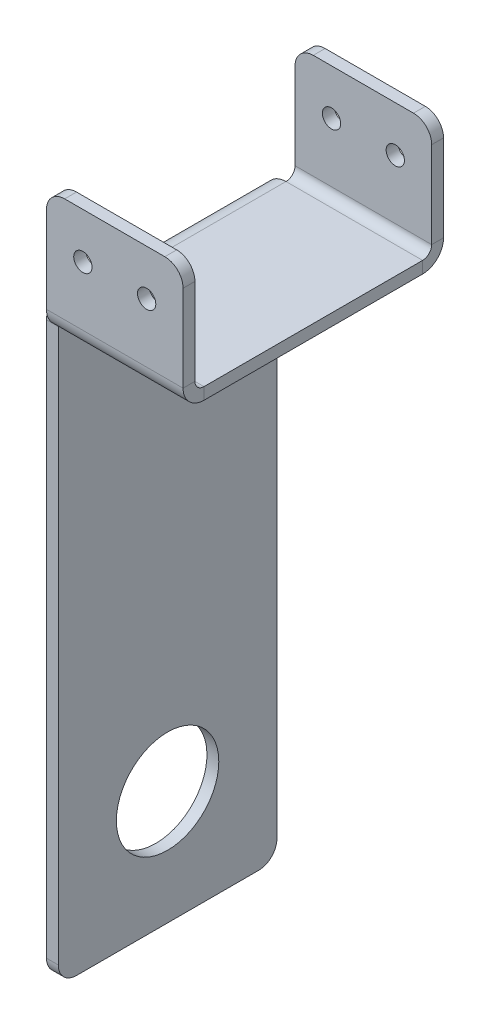
ISO-10303-21;
HEADER;
FILE_DESCRIPTION(('STEP AP214'),'2;1');
FILE_NAME('part.step','',(''),(''),'','','');
FILE_SCHEMA(('AUTOMOTIVE_DESIGN { 1 0 10303 214 1 1 1 1 }'));
ENDSEC;
DATA;
#1=APPLICATION_CONTEXT('core data for automotive mechanical design processes');
#2=APPLICATION_PROTOCOL_DEFINITION('international standard','automotive_design',2000,#1);
#3=PRODUCT_CONTEXT('',#1,'mechanical');
#4=PRODUCT('Part','Part','',(#3));
#5=PRODUCT_RELATED_PRODUCT_CATEGORY('part','',(#4));
#6=PRODUCT_DEFINITION_FORMATION('','',#4);
#7=PRODUCT_DEFINITION_CONTEXT('part definition',#1,'design');
#8=PRODUCT_DEFINITION('design','',#6,#7);
#9=PRODUCT_DEFINITION_SHAPE('','',#8);
#10=(LENGTH_UNIT() NAMED_UNIT(*) SI_UNIT(.MILLI.,.METRE.));
#11=(NAMED_UNIT(*) PLANE_ANGLE_UNIT() SI_UNIT($,.RADIAN.));
#12=(NAMED_UNIT(*) SI_UNIT($,.STERADIAN.) SOLID_ANGLE_UNIT());
#13=UNCERTAINTY_MEASURE_WITH_UNIT(LENGTH_MEASURE(1.E-05),#10,'distance_accuracy_value','');
#14=(GEOMETRIC_REPRESENTATION_CONTEXT(3) GLOBAL_UNCERTAINTY_ASSIGNED_CONTEXT((#13)) GLOBAL_UNIT_ASSIGNED_CONTEXT((#10,
#11,#12)) REPRESENTATION_CONTEXT('',''));
#15=CARTESIAN_POINT('',(0.,0.,0.));
#16=DIRECTION('',(0.,0.,1.));
#17=DIRECTION('',(1.,0.,0.));
#18=AXIS2_PLACEMENT_3D('',#15,#16,#17);
#19=CARTESIAN_POINT('',(0.,0.,36.322));
#20=DIRECTION('',(0.,0.,-1.));
#21=DIRECTION('',(-1.,0.,0.));
#22=AXIS2_PLACEMENT_3D('',#19,#20,#21);
#23=PLANE('',#22);
#24=CARTESIAN_POINT('',(8.89,19.05,36.322));
#25=DIRECTION('',(0.,0.,1.));
#26=DIRECTION('',(1.,0.,0.));
#27=AXIS2_PLACEMENT_3D('',#24,#25,#26);
#28=CIRCLE('',#27,2.5527);
#29=CARTESIAN_POINT('',(11.4427,19.05,36.322));
#30=VERTEX_POINT('',#29);
#31=EDGE_CURVE('E624',#30,#30,#28,.T.);
#32=ORIENTED_EDGE('',*,*,#31,.F.);
#33=EDGE_LOOP('',(#32));
#34=FACE_BOUND('',#33,.T.);
#35=DIRECTION('',(-1.,0.,0.));
#36=VECTOR('',#35,1.);
#37=CARTESIAN_POINT('',(0.,31.75,36.322));
#38=LINE('',#37,#36);
#39=CARTESIAN_POINT('',(13.97,31.75,36.322));
#40=VERTEX_POINT('',#39);
#41=CARTESIAN_POINT('',(-13.97,31.75,36.322));
#42=VERTEX_POINT('',#41);
#43=EDGE_CURVE('E339',#40,#42,#38,.T.);
#44=ORIENTED_EDGE('',*,*,#43,.T.);
#45=CARTESIAN_POINT('',(-13.97,26.67,36.322));
#46=DIRECTION('',(0.,0.,-1.));
#47=DIRECTION('',(-1.,0.,0.));
#48=AXIS2_PLACEMENT_3D('',#45,#46,#47);
#49=CIRCLE('',#48,5.08);
#50=CARTESIAN_POINT('',(-19.05,26.67,36.322));
#51=VERTEX_POINT('',#50);
#52=EDGE_CURVE('E425',#42,#51,#49,.F.);
#53=ORIENTED_EDGE('',*,*,#52,.T.);
#54=DIRECTION('',(0.,-1.,0.));
#55=VECTOR('',#54,1.);
#56=CARTESIAN_POINT('',(-19.05,0.,36.322));
#57=LINE('',#56,#55);
#58=CARTESIAN_POINT('',(-19.05,2.53999999999999,36.322));
#59=VERTEX_POINT('',#58);
#60=EDGE_CURVE('E346',#51,#59,#57,.T.);
#61=ORIENTED_EDGE('',*,*,#60,.T.);
#62=DIRECTION('',(1.,0.,0.));
#63=VECTOR('',#62,1.);
#64=CARTESIAN_POINT('',(-19.05,2.53999999999999,36.322));
#65=LINE('',#64,#63);
#66=CARTESIAN_POINT('',(19.05,2.53999999999999,36.322));
#67=VERTEX_POINT('',#66);
#68=EDGE_CURVE('E356',#67,#59,#65,.F.);
#69=ORIENTED_EDGE('',*,*,#68,.F.);
#70=DIRECTION('',(0.,1.,0.));
#71=VECTOR('',#70,1.);
#72=CARTESIAN_POINT('',(19.05,0.,36.322));
#73=LINE('',#72,#71);
#74=CARTESIAN_POINT('',(19.05,26.67,36.322));
#75=VERTEX_POINT('',#74);
#76=EDGE_CURVE('E343',#67,#75,#73,.T.);
#77=ORIENTED_EDGE('',*,*,#76,.T.);
#78=CARTESIAN_POINT('',(13.97,26.67,36.322));
#79=DIRECTION('',(0.,0.,-1.));
#80=DIRECTION('',(-1.,0.,0.));
#81=AXIS2_PLACEMENT_3D('',#78,#79,#80);
#82=CIRCLE('',#81,5.08);
#83=EDGE_CURVE('E423',#75,#40,#82,.F.);
#84=ORIENTED_EDGE('',*,*,#83,.T.);
#85=EDGE_LOOP('',(#44,#53,#61,#69,#77,#84));
#86=FACE_BOUND('',#85,.T.);
#87=CARTESIAN_POINT('',(-8.88999999999999,19.05,36.322));
#88=DIRECTION('',(0.,0.,1.));
#89=DIRECTION('',(1.,0.,0.));
#90=AXIS2_PLACEMENT_3D('',#87,#88,#89);
#91=CIRCLE('',#90,2.5527);
#92=CARTESIAN_POINT('',(-6.3373,19.05,36.322));
#93=VERTEX_POINT('',#92);
#94=EDGE_CURVE('E634',#93,#93,#91,.T.);
#95=ORIENTED_EDGE('',*,*,#94,.F.);
#96=EDGE_LOOP('',(#95));
#97=FACE_BOUND('',#96,.T.);
#98=ADVANCED_FACE('F98',(#34,#86,#97),#23,.F.);
#99=CARTESIAN_POINT('',(19.05,-3.302,30.48));
#100=DIRECTION('',(1.,0.,0.));
#101=DIRECTION('',(0.,0.,-1.));
#102=AXIS2_PLACEMENT_3D('',#99,#100,#101);
#103=PLANE('',#102);
#104=DIRECTION('',(0.,0.,-1.));
#105=VECTOR('',#104,1.);
#106=CARTESIAN_POINT('',(19.05,0.,30.48));
#107=LINE('',#106,#105);
#108=CARTESIAN_POINT('',(19.05,0.,30.48));
#109=VERTEX_POINT('',#108);
#110=CARTESIAN_POINT('',(19.05,0.,-30.48));
#111=VERTEX_POINT('',#110);
#112=EDGE_CURVE('E369',#109,#111,#107,.T.);
#113=ORIENTED_EDGE('',*,*,#112,.F.);
#114=DIRECTION('',(0.,1.,0.));
#115=VECTOR('',#114,1.);
#116=CARTESIAN_POINT('',(19.05,-3.302,30.48));
#117=LINE('',#116,#115);
#118=CARTESIAN_POINT('',(19.05,-3.302,30.48));
#119=VERTEX_POINT('',#118);
#120=EDGE_CURVE('E398',#119,#109,#117,.T.);
#121=ORIENTED_EDGE('',*,*,#120,.F.);
#122=DIRECTION('',(0.,0.,-1.));
#123=VECTOR('',#122,1.);
#124=CARTESIAN_POINT('',(19.05,-3.302,30.48));
#125=LINE('',#124,#123);
#126=CARTESIAN_POINT('',(19.05,-3.302,-30.48));
#127=VERTEX_POINT('',#126);
#128=EDGE_CURVE('E378',#119,#127,#125,.T.);
#129=ORIENTED_EDGE('',*,*,#128,.T.);
#130=DIRECTION('',(0.,1.,0.));
#131=VECTOR('',#130,1.);
#132=CARTESIAN_POINT('',(19.05,-3.302,-30.48));
#133=LINE('',#132,#131);
#134=EDGE_CURVE('E390',#127,#111,#133,.T.);
#135=ORIENTED_EDGE('',*,*,#134,.T.);
#136=EDGE_LOOP('',(#113,#121,#129,#135));
#137=FACE_BOUND('',#136,.T.);
#138=ADVANCED_FACE('F539',(#137),#103,.T.);
#139=CARTESIAN_POINT('',(0.,-3.302,0.));
#140=DIRECTION('',(0.,-1.,0.));
#141=DIRECTION('',(0.,0.,-1.));
#142=AXIS2_PLACEMENT_3D('',#139,#140,#141);
#143=PLANE('',#142);
#144=ORIENTED_EDGE('',*,*,#128,.F.);
#145=DIRECTION('',(1.,0.,0.));
#146=VECTOR('',#145,1.);
#147=CARTESIAN_POINT('',(-19.05,-3.302,30.48));
#148=LINE('',#147,#146);
#149=CARTESIAN_POINT('',(-19.05,-3.30199999999999,30.48));
#150=VERTEX_POINT('',#149);
#151=EDGE_CURVE('E387',#150,#119,#148,.T.);
#152=ORIENTED_EDGE('',*,*,#151,.F.);
#153=DIRECTION('',(0.,0.,1.));
#154=VECTOR('',#153,1.);
#155=CARTESIAN_POINT('',(-19.05,-3.302,30.48));
#156=LINE('',#155,#154);
#157=CARTESIAN_POINT('',(-19.05,-3.30200000000003,-30.48));
#158=VERTEX_POINT('',#157);
#159=EDGE_CURVE('E385',#158,#150,#156,.T.);
#160=ORIENTED_EDGE('',*,*,#159,.F.);
#161=DIRECTION('',(-1.,0.,0.));
#162=VECTOR('',#161,1.);
#163=CARTESIAN_POINT('',(-19.05,-3.302,-30.48));
#164=LINE('',#163,#162);
#165=EDGE_CURVE('E381',#127,#158,#164,.T.);
#166=ORIENTED_EDGE('',*,*,#165,.F.);
#167=EDGE_LOOP('',(#144,#152,#160,#166));
#168=FACE_BOUND('',#167,.T.);
#169=ADVANCED_FACE('F483',(#168),#143,.T.);
#170=CARTESIAN_POINT('',(0.,0.,0.));
#171=DIRECTION('',(0.,-1.,0.));
#172=DIRECTION('',(0.,0.,-1.));
#173=AXIS2_PLACEMENT_3D('',#170,#171,#172);
#174=PLANE('',#173);
#175=ORIENTED_EDGE('',*,*,#112,.T.);
#176=DIRECTION('',(-1.,0.,0.));
#177=VECTOR('',#176,1.);
#178=CARTESIAN_POINT('',(-19.05,0.,-30.48));
#179=LINE('',#178,#177);
#180=CARTESIAN_POINT('',(-19.05,0.,-30.48));
#181=VERTEX_POINT('',#180);
#182=EDGE_CURVE('E393',#111,#181,#179,.T.);
#183=ORIENTED_EDGE('',*,*,#182,.T.);
#184=DIRECTION('',(0.,0.,1.));
#185=VECTOR('',#184,1.);
#186=CARTESIAN_POINT('',(-19.05,0.,30.48));
#187=LINE('',#186,#185);
#188=CARTESIAN_POINT('',(-19.05,0.,30.48));
#189=VERTEX_POINT('',#188);
#190=EDGE_CURVE('E257',#181,#189,#187,.T.);
#191=ORIENTED_EDGE('',*,*,#190,.T.);
#192=DIRECTION('',(1.,0.,0.));
#193=VECTOR('',#192,1.);
#194=CARTESIAN_POINT('',(-19.05,0.,30.48));
#195=LINE('',#194,#193);
#196=EDGE_CURVE('E382',#189,#109,#195,.T.);
#197=ORIENTED_EDGE('',*,*,#196,.T.);
#198=EDGE_LOOP('',(#175,#183,#191,#197));
#199=FACE_BOUND('',#198,.T.);
#200=ADVANCED_FACE('F689',(#199),#174,.F.);
#201=CARTESIAN_POINT('',(-19.05,2.53999999999999,30.48));
#202=DIRECTION('',(-1.,0.,0.));
#203=DIRECTION('',(0.,0.,1.));
#204=AXIS2_PLACEMENT_3D('',#201,#202,#203);
#205=PLANE('',#204);
#206=DIRECTION('',(0.,0.,-1.));
#207=VECTOR('',#206,1.);
#208=CARTESIAN_POINT('',(-19.05,2.53999999999999,36.322));
#209=LINE('',#208,#207);
#210=CARTESIAN_POINT('',(-19.05,2.53999999999999,33.02));
#211=VERTEX_POINT('',#210);
#212=EDGE_CURVE('E330',#211,#59,#209,.F.);
#213=ORIENTED_EDGE('',*,*,#212,.F.);
#214=CARTESIAN_POINT('',(-19.05,2.53999999999999,30.48));
#215=DIRECTION('',(1.,0.,0.));
#216=DIRECTION('',(0.,0.,-1.));
#217=AXIS2_PLACEMENT_3D('',#214,#215,#216);
#218=CIRCLE('',#217,2.53999999999999);
#219=EDGE_CURVE('E373',#189,#211,#218,.F.);
#220=ORIENTED_EDGE('',*,*,#219,.F.);
#221=DIRECTION('',(0.,1.,0.));
#222=VECTOR('',#221,1.);
#223=CARTESIAN_POINT('',(-19.05,-3.302,30.48));
#224=LINE('',#223,#222);
#225=EDGE_CURVE('E402',#150,#189,#224,.T.);
#226=ORIENTED_EDGE('',*,*,#225,.F.);
#227=CARTESIAN_POINT('',(-19.05,2.53999999999999,30.48));
#228=DIRECTION('',(1.,0.,0.));
#229=DIRECTION('',(0.,0.,-1.));
#230=AXIS2_PLACEMENT_3D('',#227,#228,#229);
#231=CIRCLE('',#230,5.84199999999999);
#232=EDGE_CURVE('E366',#150,#59,#231,.F.);
#233=ORIENTED_EDGE('',*,*,#232,.T.);
#234=EDGE_LOOP('',(#213,#220,#226,#233));
#235=FACE_BOUND('',#234,.T.);
#236=ADVANCED_FACE('F490',(#235),#205,.T.);
#237=CARTESIAN_POINT('',(19.05,2.53999999999999,30.48));
#238=DIRECTION('',(-1.,0.,0.));
#239=DIRECTION('',(0.,0.,1.));
#240=AXIS2_PLACEMENT_3D('',#237,#238,#239);
#241=PLANE('',#240);
#242=CARTESIAN_POINT('',(19.05,2.53999999999999,30.48));
#243=DIRECTION('',(1.,0.,0.));
#244=DIRECTION('',(0.,0.,-1.));
#245=AXIS2_PLACEMENT_3D('',#242,#243,#244);
#246=CIRCLE('',#245,2.53999999999999);
#247=CARTESIAN_POINT('',(19.05,2.53999999999999,33.02));
#248=VERTEX_POINT('',#247);
#249=EDGE_CURVE('E342',#248,#109,#246,.T.);
#250=ORIENTED_EDGE('',*,*,#249,.F.);
#251=DIRECTION('',(0.,0.,-1.));
#252=VECTOR('',#251,1.);
#253=CARTESIAN_POINT('',(19.05,2.53999999999999,33.02));
#254=LINE('',#253,#252);
#255=EDGE_CURVE('E359',#248,#67,#254,.F.);
#256=ORIENTED_EDGE('',*,*,#255,.T.);
#257=CARTESIAN_POINT('',(19.05,2.53999999999999,30.48));
#258=DIRECTION('',(1.,0.,0.));
#259=DIRECTION('',(0.,0.,-1.));
#260=AXIS2_PLACEMENT_3D('',#257,#258,#259);
#261=CIRCLE('',#260,5.84199999999999);
#262=EDGE_CURVE('E370',#67,#119,#261,.T.);
#263=ORIENTED_EDGE('',*,*,#262,.T.);
#264=ORIENTED_EDGE('',*,*,#120,.T.);
#265=EDGE_LOOP('',(#250,#256,#263,#264));
#266=FACE_BOUND('',#265,.T.);
#267=ADVANCED_FACE('F681',(#266),#241,.F.);
#268=CARTESIAN_POINT('',(19.05,2.53999999999999,30.48));
#269=DIRECTION('',(1.,0.,0.));
#270=DIRECTION('',(0.,0.,1.));
#271=AXIS2_PLACEMENT_3D('',#268,#269,#270);
#272=CYLINDRICAL_SURFACE('',#271,5.84199999999999);
#273=ORIENTED_EDGE('',*,*,#151,.T.);
#274=ORIENTED_EDGE('',*,*,#262,.F.);
#275=ORIENTED_EDGE('',*,*,#68,.T.);
#276=ORIENTED_EDGE('',*,*,#232,.F.);
#277=EDGE_LOOP('',(#273,#274,#275,#276));
#278=FACE_BOUND('',#277,.T.);
#279=ADVANCED_FACE('F491',(#278),#272,.T.);
#280=CARTESIAN_POINT('',(19.05,2.53999999999999,30.48));
#281=DIRECTION('',(1.,0.,0.));
#282=DIRECTION('',(0.,0.,1.));
#283=AXIS2_PLACEMENT_3D('',#280,#281,#282);
#284=CYLINDRICAL_SURFACE('',#283,2.53999999999999);
#285=ORIENTED_EDGE('',*,*,#196,.F.);
#286=ORIENTED_EDGE('',*,*,#219,.T.);
#287=DIRECTION('',(1.,0.,0.));
#288=VECTOR('',#287,1.);
#289=CARTESIAN_POINT('',(-19.05,2.53999999999999,33.02));
#290=LINE('',#289,#288);
#291=EDGE_CURVE('E362',#211,#248,#290,.T.);
#292=ORIENTED_EDGE('',*,*,#291,.T.);
#293=ORIENTED_EDGE('',*,*,#249,.T.);
#294=EDGE_LOOP('',(#285,#286,#292,#293));
#295=FACE_BOUND('',#294,.T.);
#296=ADVANCED_FACE('F521',(#295),#284,.F.);
#297=CARTESIAN_POINT('',(-19.05,0.,36.322));
#298=DIRECTION('',(1.,0.,0.));
#299=DIRECTION('',(0.,1.,0.));
#300=AXIS2_PLACEMENT_3D('',#297,#298,#299);
#301=PLANE('',#300);
#302=ORIENTED_EDGE('',*,*,#60,.F.);
#303=DIRECTION('',(0.,0.,-1.));
#304=VECTOR('',#303,1.);
#305=CARTESIAN_POINT('',(-19.05,26.67,36.322));
#306=LINE('',#305,#304);
#307=CARTESIAN_POINT('',(-19.05,26.67,33.02));
#308=VERTEX_POINT('',#307);
#309=EDGE_CURVE('E401',#51,#308,#306,.T.);
#310=ORIENTED_EDGE('',*,*,#309,.T.);
#311=DIRECTION('',(0.,1.,0.));
#312=VECTOR('',#311,1.);
#313=CARTESIAN_POINT('',(-19.05,0.,33.02));
#314=LINE('',#313,#312);
#315=EDGE_CURVE('E354',#308,#211,#314,.F.);
#316=ORIENTED_EDGE('',*,*,#315,.T.);
#317=ORIENTED_EDGE('',*,*,#212,.T.);
#318=EDGE_LOOP('',(#302,#310,#316,#317));
#319=FACE_BOUND('',#318,.T.);
#320=ADVANCED_FACE('F516',(#319),#301,.F.);
#321=CARTESIAN_POINT('',(19.05,31.75,36.322));
#322=DIRECTION('',(-1.,0.,0.));
#323=DIRECTION('',(0.,-1.,0.));
#324=AXIS2_PLACEMENT_3D('',#321,#322,#323);
#325=PLANE('',#324);
#326=DIRECTION('',(0.,-1.,0.));
#327=VECTOR('',#326,1.);
#328=CARTESIAN_POINT('',(19.05,31.75,33.02));
#329=LINE('',#328,#327);
#330=CARTESIAN_POINT('',(19.05,26.67,33.02));
#331=VERTEX_POINT('',#330);
#332=EDGE_CURVE('E351',#248,#331,#329,.F.);
#333=ORIENTED_EDGE('',*,*,#332,.T.);
#334=DIRECTION('',(0.,0.,-1.));
#335=VECTOR('',#334,1.);
#336=CARTESIAN_POINT('',(19.05,26.67,36.322));
#337=LINE('',#336,#335);
#338=EDGE_CURVE('E427',#331,#75,#337,.F.);
#339=ORIENTED_EDGE('',*,*,#338,.T.);
#340=ORIENTED_EDGE('',*,*,#76,.F.);
#341=ORIENTED_EDGE('',*,*,#255,.F.);
#342=EDGE_LOOP('',(#333,#339,#340,#341));
#343=FACE_BOUND('',#342,.T.);
#344=ADVANCED_FACE('F500',(#343),#325,.F.);
#345=CARTESIAN_POINT('',(0.,0.,33.02));
#346=DIRECTION('',(0.,0.,-1.));
#347=DIRECTION('',(-1.,0.,0.));
#348=AXIS2_PLACEMENT_3D('',#345,#346,#347);
#349=PLANE('',#348);
#350=CARTESIAN_POINT('',(8.89,19.05,33.02));
#351=DIRECTION('',(0.,0.,-1.));
#352=DIRECTION('',(-1.,0.,0.));
#353=AXIS2_PLACEMENT_3D('',#350,#351,#352);
#354=CIRCLE('',#353,2.55269999999999);
#355=CARTESIAN_POINT('',(6.33730000000001,19.05,33.02));
#356=VERTEX_POINT('',#355);
#357=EDGE_CURVE('E622',#356,#356,#354,.T.);
#358=ORIENTED_EDGE('',*,*,#357,.F.);
#359=EDGE_LOOP('',(#358));
#360=FACE_BOUND('',#359,.T.);
#361=CARTESIAN_POINT('',(-8.88999999999999,19.05,33.02));
#362=DIRECTION('',(0.,0.,-1.));
#363=DIRECTION('',(-1.,0.,0.));
#364=AXIS2_PLACEMENT_3D('',#361,#362,#363);
#365=CIRCLE('',#364,2.55269999999999);
#366=CARTESIAN_POINT('',(-11.4427,19.05,33.02));
#367=VERTEX_POINT('',#366);
#368=EDGE_CURVE('E640',#367,#367,#365,.T.);
#369=ORIENTED_EDGE('',*,*,#368,.F.);
#370=EDGE_LOOP('',(#369));
#371=FACE_BOUND('',#370,.T.);
#372=ORIENTED_EDGE('',*,*,#315,.F.);
#373=CARTESIAN_POINT('',(-13.97,26.67,33.02));
#374=DIRECTION('',(0.,0.,-1.));
#375=DIRECTION('',(-1.,0.,0.));
#376=AXIS2_PLACEMENT_3D('',#373,#374,#375);
#377=CIRCLE('',#376,5.08);
#378=CARTESIAN_POINT('',(-13.97,31.75,33.02));
#379=VERTEX_POINT('',#378);
#380=EDGE_CURVE('E416',#308,#379,#377,.T.);
#381=ORIENTED_EDGE('',*,*,#380,.T.);
#382=DIRECTION('',(1.,0.,0.));
#383=VECTOR('',#382,1.);
#384=CARTESIAN_POINT('',(-19.05,31.75,33.02));
#385=LINE('',#384,#383);
#386=CARTESIAN_POINT('',(13.97,31.75,33.02));
#387=VERTEX_POINT('',#386);
#388=EDGE_CURVE('E348',#387,#379,#385,.F.);
#389=ORIENTED_EDGE('',*,*,#388,.F.);
#390=CARTESIAN_POINT('',(13.97,26.67,33.02));
#391=DIRECTION('',(0.,0.,-1.));
#392=DIRECTION('',(-1.,0.,0.));
#393=AXIS2_PLACEMENT_3D('',#390,#391,#392);
#394=CIRCLE('',#393,5.08);
#395=EDGE_CURVE('E414',#387,#331,#394,.T.);
#396=ORIENTED_EDGE('',*,*,#395,.T.);
#397=ORIENTED_EDGE('',*,*,#332,.F.);
#398=ORIENTED_EDGE('',*,*,#291,.F.);
#399=EDGE_LOOP('',(#372,#381,#389,#396,#397,#398));
#400=FACE_BOUND('',#399,.T.);
#401=ADVANCED_FACE('F524',(#360,#371,#400),#349,.T.);
#402=CARTESIAN_POINT('',(-19.05,31.75,36.322));
#403=DIRECTION('',(0.,-1.,0.));
#404=DIRECTION('',(0.,0.,-1.));
#405=AXIS2_PLACEMENT_3D('',#402,#403,#404);
#406=PLANE('',#405);
#407=ORIENTED_EDGE('',*,*,#388,.T.);
#408=DIRECTION('',(0.,0.,-1.));
#409=VECTOR('',#408,1.);
#410=CARTESIAN_POINT('',(-13.97,31.75,36.322));
#411=LINE('',#410,#409);
#412=EDGE_CURVE('E421',#379,#42,#411,.F.);
#413=ORIENTED_EDGE('',*,*,#412,.T.);
#414=ORIENTED_EDGE('',*,*,#43,.F.);
#415=DIRECTION('',(0.,0.,-1.));
#416=VECTOR('',#415,1.);
#417=CARTESIAN_POINT('',(13.97,31.75,36.322));
#418=LINE('',#417,#416);
#419=EDGE_CURVE('E418',#40,#387,#418,.T.);
#420=ORIENTED_EDGE('',*,*,#419,.T.);
#421=EDGE_LOOP('',(#407,#413,#414,#420));
#422=FACE_BOUND('',#421,.T.);
#423=ADVANCED_FACE('F509',(#422),#406,.F.);
#424=CARTESIAN_POINT('',(19.05,2.53999999999997,-30.48));
#425=DIRECTION('',(1.,0.,0.));
#426=DIRECTION('',(0.,0.,-1.));
#427=AXIS2_PLACEMENT_3D('',#424,#425,#426);
#428=PLANE('',#427);
#429=DIRECTION('',(0.,0.,1.));
#430=VECTOR('',#429,1.);
#431=CARTESIAN_POINT('',(19.05,2.54000000000001,-36.322));
#432=LINE('',#431,#430);
#433=CARTESIAN_POINT('',(19.05,2.53999999999996,-33.02));
#434=VERTEX_POINT('',#433);
#435=CARTESIAN_POINT('',(19.05,2.53999999999995,-36.322));
#436=VERTEX_POINT('',#435);
#437=EDGE_CURVE('E295',#434,#436,#432,.F.);
#438=ORIENTED_EDGE('',*,*,#437,.F.);
#439=CARTESIAN_POINT('',(19.05,2.53999999999997,-30.48));
#440=DIRECTION('',(-1.,0.,0.));
#441=DIRECTION('',(0.,0.,1.));
#442=AXIS2_PLACEMENT_3D('',#439,#440,#441);
#443=CIRCLE('',#442,2.54);
#444=EDGE_CURVE('E334',#111,#434,#443,.F.);
#445=ORIENTED_EDGE('',*,*,#444,.F.);
#446=ORIENTED_EDGE('',*,*,#134,.F.);
#447=CARTESIAN_POINT('',(19.05,2.53999999999997,-30.48));
#448=DIRECTION('',(-1.,0.,0.));
#449=DIRECTION('',(0.,0.,1.));
#450=AXIS2_PLACEMENT_3D('',#447,#448,#449);
#451=CIRCLE('',#450,5.842);
#452=EDGE_CURVE('E327',#127,#436,#451,.F.);
#453=ORIENTED_EDGE('',*,*,#452,.T.);
#454=EDGE_LOOP('',(#438,#445,#446,#453));
#455=FACE_BOUND('',#454,.T.);
#456=ADVANCED_FACE('F532',(#455),#428,.T.);
#457=CARTESIAN_POINT('',(-19.05,2.53999999999997,-30.48));
#458=DIRECTION('',(1.,0.,0.));
#459=DIRECTION('',(0.,0.,-1.));
#460=AXIS2_PLACEMENT_3D('',#457,#458,#459);
#461=PLANE('',#460);
#462=CARTESIAN_POINT('',(-19.05,2.53999999999997,-30.48));
#463=DIRECTION('',(-1.,0.,0.));
#464=DIRECTION('',(0.,0.,1.));
#465=AXIS2_PLACEMENT_3D('',#462,#463,#464);
#466=CIRCLE('',#465,2.54);
#467=CARTESIAN_POINT('',(-19.05,2.53999999999996,-33.02));
#468=VERTEX_POINT('',#467);
#469=EDGE_CURVE('E303',#468,#181,#466,.T.);
#470=ORIENTED_EDGE('',*,*,#469,.F.);
#471=DIRECTION('',(0.,0.,1.));
#472=VECTOR('',#471,1.);
#473=CARTESIAN_POINT('',(-19.05,2.53999999999999,-33.02));
#474=LINE('',#473,#472);
#475=CARTESIAN_POINT('',(-19.05,2.54000000000001,-36.322));
#476=VERTEX_POINT('',#475);
#477=EDGE_CURVE('E320',#468,#476,#474,.F.);
#478=ORIENTED_EDGE('',*,*,#477,.T.);
#479=CARTESIAN_POINT('',(-19.05,2.53999999999997,-30.48));
#480=DIRECTION('',(-1.,0.,0.));
#481=DIRECTION('',(0.,0.,1.));
#482=AXIS2_PLACEMENT_3D('',#479,#480,#481);
#483=CIRCLE('',#482,5.842);
#484=EDGE_CURVE('E331',#476,#158,#483,.T.);
#485=ORIENTED_EDGE('',*,*,#484,.T.);
#486=DIRECTION('',(0.,1.,0.));
#487=VECTOR('',#486,1.);
#488=CARTESIAN_POINT('',(-19.05,-3.302,-30.48));
#489=LINE('',#488,#487);
#490=EDGE_CURVE('E405',#158,#181,#489,.T.);
#491=ORIENTED_EDGE('',*,*,#490,.T.);
#492=EDGE_LOOP('',(#470,#478,#485,#491));
#493=FACE_BOUND('',#492,.T.);
#494=ADVANCED_FACE('F548',(#493),#461,.F.);
#495=CARTESIAN_POINT('',(-19.05,2.53999999999997,-30.48));
#496=DIRECTION('',(-1.,0.,0.));
#497=DIRECTION('',(0.,0.,-1.));
#498=AXIS2_PLACEMENT_3D('',#495,#496,#497);
#499=CYLINDRICAL_SURFACE('',#498,5.842);
#500=ORIENTED_EDGE('',*,*,#165,.T.);
#501=ORIENTED_EDGE('',*,*,#484,.F.);
#502=DIRECTION('',(-1.,0.,0.));
#503=VECTOR('',#502,1.);
#504=CARTESIAN_POINT('',(19.05,2.54000000000001,-36.322));
#505=LINE('',#504,#503);
#506=EDGE_CURVE('E317',#476,#436,#505,.F.);
#507=ORIENTED_EDGE('',*,*,#506,.T.);
#508=ORIENTED_EDGE('',*,*,#452,.F.);
#509=EDGE_LOOP('',(#500,#501,#507,#508));
#510=FACE_BOUND('',#509,.T.);
#511=ADVANCED_FACE('F551',(#510),#499,.T.);
#512=CARTESIAN_POINT('',(-19.05,2.53999999999997,-30.48));
#513=DIRECTION('',(-1.,0.,0.));
#514=DIRECTION('',(0.,0.,-1.));
#515=AXIS2_PLACEMENT_3D('',#512,#513,#514);
#516=CYLINDRICAL_SURFACE('',#515,2.54);
#517=ORIENTED_EDGE('',*,*,#182,.F.);
#518=ORIENTED_EDGE('',*,*,#444,.T.);
#519=DIRECTION('',(-1.,0.,0.));
#520=VECTOR('',#519,1.);
#521=CARTESIAN_POINT('',(19.05,2.53999999999999,-33.02));
#522=LINE('',#521,#520);
#523=EDGE_CURVE('E323',#434,#468,#522,.T.);
#524=ORIENTED_EDGE('',*,*,#523,.T.);
#525=ORIENTED_EDGE('',*,*,#469,.T.);
#526=EDGE_LOOP('',(#517,#518,#524,#525));
#527=FACE_BOUND('',#526,.T.);
#528=ADVANCED_FACE('F556',(#527),#516,.F.);
#529=CARTESIAN_POINT('',(19.05,0.,-36.322));
#530=DIRECTION('',(-1.,0.,0.));
#531=DIRECTION('',(0.,-1.,0.));
#532=AXIS2_PLACEMENT_3D('',#529,#530,#531);
#533=PLANE('',#532);
#534=DIRECTION('',(0.,-1.,0.));
#535=VECTOR('',#534,1.);
#536=CARTESIAN_POINT('',(19.05,-1.26436954429564E-13,-36.322));
#537=LINE('',#536,#535);
#538=CARTESIAN_POINT('',(19.05,26.67,-36.3220000000001));
#539=VERTEX_POINT('',#538);
#540=EDGE_CURVE('E307',#539,#436,#537,.T.);
#541=ORIENTED_EDGE('',*,*,#540,.F.);
#542=DIRECTION('',(0.,0.,1.));
#543=VECTOR('',#542,1.);
#544=CARTESIAN_POINT('',(19.05,26.67,-36.3220000000001));
#545=LINE('',#544,#543);
#546=CARTESIAN_POINT('',(19.05,26.67,-33.0200000000001));
#547=VERTEX_POINT('',#546);
#548=EDGE_CURVE('E444',#539,#547,#545,.T.);
#549=ORIENTED_EDGE('',*,*,#548,.T.);
#550=DIRECTION('',(0.,1.,0.));
#551=VECTOR('',#550,1.);
#552=CARTESIAN_POINT('',(19.05,0.,-33.02));
#553=LINE('',#552,#551);
#554=EDGE_CURVE('E315',#547,#434,#553,.F.);
#555=ORIENTED_EDGE('',*,*,#554,.T.);
#556=ORIENTED_EDGE('',*,*,#437,.T.);
#557=EDGE_LOOP('',(#541,#549,#555,#556));
#558=FACE_BOUND('',#557,.T.);
#559=ADVANCED_FACE('F559',(#558),#533,.F.);
#560=CARTESIAN_POINT('',(-19.05,31.75,-36.3220000000001));
#561=DIRECTION('',(1.,0.,0.));
#562=DIRECTION('',(0.,1.,0.));
#563=AXIS2_PLACEMENT_3D('',#560,#561,#562);
#564=PLANE('',#563);
#565=DIRECTION('',(0.,-1.,0.));
#566=VECTOR('',#565,1.);
#567=CARTESIAN_POINT('',(-19.05,31.75,-33.0200000000001));
#568=LINE('',#567,#566);
#569=CARTESIAN_POINT('',(-19.05,26.67,-33.0200000000001));
#570=VERTEX_POINT('',#569);
#571=EDGE_CURVE('E312',#468,#570,#568,.F.);
#572=ORIENTED_EDGE('',*,*,#571,.T.);
#573=DIRECTION('',(0.,0.,1.));
#574=VECTOR('',#573,1.);
#575=CARTESIAN_POINT('',(-19.05,26.67,-36.3220000000001));
#576=LINE('',#575,#574);
#577=CARTESIAN_POINT('',(-19.05,26.67,-36.3220000000001));
#578=VERTEX_POINT('',#577);
#579=EDGE_CURVE('E438',#570,#578,#576,.F.);
#580=ORIENTED_EDGE('',*,*,#579,.T.);
#581=DIRECTION('',(0.,1.,0.));
#582=VECTOR('',#581,1.);
#583=CARTESIAN_POINT('',(-19.05,-1.05620272717842E-13,-36.322));
#584=LINE('',#583,#582);
#585=EDGE_CURVE('E304',#476,#578,#584,.T.);
#586=ORIENTED_EDGE('',*,*,#585,.F.);
#587=ORIENTED_EDGE('',*,*,#477,.F.);
#588=EDGE_LOOP('',(#572,#580,#586,#587));
#589=FACE_BOUND('',#588,.T.);
#590=ADVANCED_FACE('F566',(#589),#564,.F.);
#591=CARTESIAN_POINT('',(0.,-1.18110281744875E-13,-36.322));
#592=DIRECTION('',(0.,0.,1.));
#593=DIRECTION('',(0.,-1.,0.));
#594=AXIS2_PLACEMENT_3D('',#591,#592,#593);
#595=PLANE('',#594);
#596=CARTESIAN_POINT('',(8.89,19.05,-36.3220000000001));
#597=DIRECTION('',(0.,0.,1.));
#598=DIRECTION('',(1.,0.,0.));
#599=AXIS2_PLACEMENT_3D('',#596,#597,#598);
#600=CIRCLE('',#599,2.55269999999999);
#601=CARTESIAN_POINT('',(11.4427,19.05,-36.3220000000001));
#602=VERTEX_POINT('',#601);
#603=EDGE_CURVE('E625',#602,#602,#600,.T.);
#604=ORIENTED_EDGE('',*,*,#603,.T.);
#605=EDGE_LOOP('',(#604));
#606=FACE_BOUND('',#605,.T.);
#607=CARTESIAN_POINT('',(-8.88999999999999,19.05,-36.3220000000001));
#608=DIRECTION('',(0.,0.,1.));
#609=DIRECTION('',(1.,0.,0.));
#610=AXIS2_PLACEMENT_3D('',#607,#608,#609);
#611=CIRCLE('',#610,2.55269999999999);
#612=CARTESIAN_POINT('',(-6.3373,19.05,-36.3220000000001));
#613=VERTEX_POINT('',#612);
#614=EDGE_CURVE('E637',#613,#613,#611,.T.);
#615=ORIENTED_EDGE('',*,*,#614,.T.);
#616=EDGE_LOOP('',(#615));
#617=FACE_BOUND('',#616,.T.);
#618=ORIENTED_EDGE('',*,*,#585,.T.);
#619=CARTESIAN_POINT('',(-13.97,26.67,-36.3220000000001));
#620=DIRECTION('',(0.,0.,1.));
#621=DIRECTION('',(0.,-1.,0.));
#622=AXIS2_PLACEMENT_3D('',#619,#620,#621);
#623=CIRCLE('',#622,5.08);
#624=CARTESIAN_POINT('',(-13.97,31.75,-36.3220000000001));
#625=VERTEX_POINT('',#624);
#626=EDGE_CURVE('E442',#578,#625,#623,.F.);
#627=ORIENTED_EDGE('',*,*,#626,.T.);
#628=DIRECTION('',(1.,0.,0.));
#629=VECTOR('',#628,1.);
#630=CARTESIAN_POINT('',(0.,31.75,-36.3220000000001));
#631=LINE('',#630,#629);
#632=CARTESIAN_POINT('',(13.97,31.75,-36.3220000000001));
#633=VERTEX_POINT('',#632);
#634=EDGE_CURVE('E300',#625,#633,#631,.T.);
#635=ORIENTED_EDGE('',*,*,#634,.T.);
#636=CARTESIAN_POINT('',(13.97,26.67,-36.3220000000001));
#637=DIRECTION('',(0.,0.,1.));
#638=DIRECTION('',(0.,-1.,0.));
#639=AXIS2_PLACEMENT_3D('',#636,#637,#638);
#640=CIRCLE('',#639,5.08);
#641=EDGE_CURVE('E440',#633,#539,#640,.F.);
#642=ORIENTED_EDGE('',*,*,#641,.T.);
#643=ORIENTED_EDGE('',*,*,#540,.T.);
#644=ORIENTED_EDGE('',*,*,#506,.F.);
#645=EDGE_LOOP('',(#618,#627,#635,#642,#643,#644));
#646=FACE_BOUND('',#645,.T.);
#647=ADVANCED_FACE('F570',(#606,#617,#646),#595,.F.);
#648=CARTESIAN_POINT('',(0.,-1.06581410364015E-13,-33.02));
#649=DIRECTION('',(0.,0.,1.));
#650=DIRECTION('',(0.,-1.,0.));
#651=AXIS2_PLACEMENT_3D('',#648,#649,#650);
#652=PLANE('',#651);
#653=CARTESIAN_POINT('',(8.89,19.05,-33.0200000000001));
#654=DIRECTION('',(0.,0.,1.));
#655=DIRECTION('',(0.,-1.,0.));
#656=AXIS2_PLACEMENT_3D('',#653,#654,#655);
#657=CIRCLE('',#656,2.55269999999999);
#658=CARTESIAN_POINT('',(8.89,16.4973,-33.0200000000001));
#659=VERTEX_POINT('',#658);
#660=EDGE_CURVE('E631',#659,#659,#657,.T.);
#661=ORIENTED_EDGE('',*,*,#660,.F.);
#662=EDGE_LOOP('',(#661));
#663=FACE_BOUND('',#662,.T.);
#664=CARTESIAN_POINT('',(-8.88999999999999,19.05,-33.0200000000001));
#665=DIRECTION('',(0.,0.,1.));
#666=DIRECTION('',(0.,-1.,0.));
#667=AXIS2_PLACEMENT_3D('',#664,#665,#666);
#668=CIRCLE('',#667,2.55269999999999);
#669=CARTESIAN_POINT('',(-8.88999999999999,16.4973,-33.0200000000001));
#670=VERTEX_POINT('',#669);
#671=EDGE_CURVE('E643',#670,#670,#668,.T.);
#672=ORIENTED_EDGE('',*,*,#671,.F.);
#673=EDGE_LOOP('',(#672));
#674=FACE_BOUND('',#673,.T.);
#675=DIRECTION('',(-1.,0.,0.));
#676=VECTOR('',#675,1.);
#677=CARTESIAN_POINT('',(19.05,31.75,-33.0200000000001));
#678=LINE('',#677,#676);
#679=CARTESIAN_POINT('',(-13.97,31.75,-33.0200000000001));
#680=VERTEX_POINT('',#679);
#681=CARTESIAN_POINT('',(13.97,31.75,-33.0200000000001));
#682=VERTEX_POINT('',#681);
#683=EDGE_CURVE('E309',#680,#682,#678,.F.);
#684=ORIENTED_EDGE('',*,*,#683,.F.);
#685=CARTESIAN_POINT('',(-13.97,26.67,-33.0200000000001));
#686=DIRECTION('',(0.,0.,1.));
#687=DIRECTION('',(0.,-1.,0.));
#688=AXIS2_PLACEMENT_3D('',#685,#686,#687);
#689=CIRCLE('',#688,5.08);
#690=EDGE_CURVE('E436',#680,#570,#689,.T.);
#691=ORIENTED_EDGE('',*,*,#690,.T.);
#692=ORIENTED_EDGE('',*,*,#571,.F.);
#693=ORIENTED_EDGE('',*,*,#523,.F.);
#694=ORIENTED_EDGE('',*,*,#554,.F.);
#695=CARTESIAN_POINT('',(13.97,26.67,-33.0200000000001));
#696=DIRECTION('',(0.,0.,1.));
#697=DIRECTION('',(0.,-1.,0.));
#698=AXIS2_PLACEMENT_3D('',#695,#696,#697);
#699=CIRCLE('',#698,5.08);
#700=EDGE_CURVE('E434',#547,#682,#699,.T.);
#701=ORIENTED_EDGE('',*,*,#700,.T.);
#702=EDGE_LOOP('',(#684,#691,#692,#693,#694,#701));
#703=FACE_BOUND('',#702,.T.);
#704=ADVANCED_FACE('F575',(#663,#674,#703),#652,.T.);
#705=CARTESIAN_POINT('',(19.05,31.75,-36.3220000000001));
#706=DIRECTION('',(0.,-1.,0.));
#707=DIRECTION('',(0.,0.,-1.));
#708=AXIS2_PLACEMENT_3D('',#705,#706,#707);
#709=PLANE('',#708);
#710=ORIENTED_EDGE('',*,*,#634,.F.);
#711=DIRECTION('',(0.,0.,1.));
#712=VECTOR('',#711,1.);
#713=CARTESIAN_POINT('',(-13.97,31.75,-36.3220000000001));
#714=LINE('',#713,#712);
#715=EDGE_CURVE('E431',#625,#680,#714,.T.);
#716=ORIENTED_EDGE('',*,*,#715,.T.);
#717=ORIENTED_EDGE('',*,*,#683,.T.);
#718=DIRECTION('',(0.,0.,1.));
#719=VECTOR('',#718,1.);
#720=CARTESIAN_POINT('',(13.97,31.75,-36.3220000000001));
#721=LINE('',#720,#719);
#722=EDGE_CURVE('E429',#682,#633,#721,.F.);
#723=ORIENTED_EDGE('',*,*,#722,.T.);
#724=EDGE_LOOP('',(#710,#716,#717,#723));
#725=FACE_BOUND('',#724,.T.);
#726=ADVANCED_FACE('F572',(#725),#709,.F.);
#727=CARTESIAN_POINT('',(-19.05,-5.842,30.48));
#728=DIRECTION('',(0.,0.,1.));
#729=DIRECTION('',(0.,-1.,0.));
#730=AXIS2_PLACEMENT_3D('',#727,#728,#729);
#731=PLANE('',#730);
#732=DIRECTION('',(1.,0.,0.));
#733=VECTOR('',#732,1.);
#734=CARTESIAN_POINT('',(-24.892,-5.84199999999998,30.48));
#735=LINE('',#734,#733);
#736=CARTESIAN_POINT('',(-21.59,-5.84199999999999,30.48));
#737=VERTEX_POINT('',#736);
#738=CARTESIAN_POINT('',(-24.892,-5.84199999999998,30.48));
#739=VERTEX_POINT('',#738);
#740=EDGE_CURVE('E291',#737,#739,#735,.F.);
#741=ORIENTED_EDGE('',*,*,#740,.F.);
#742=CARTESIAN_POINT('',(-19.05,-5.842,30.48));
#743=DIRECTION('',(0.,0.,-1.));
#744=DIRECTION('',(0.,1.,0.));
#745=AXIS2_PLACEMENT_3D('',#742,#743,#744);
#746=CIRCLE('',#745,2.54);
#747=EDGE_CURVE('E261',#150,#737,#746,.F.);
#748=ORIENTED_EDGE('',*,*,#747,.F.);
#749=ORIENTED_EDGE('',*,*,#225,.T.);
#750=CARTESIAN_POINT('',(-19.05,-5.842,30.48));
#751=DIRECTION('',(0.,0.,-1.));
#752=DIRECTION('',(0.,1.,0.));
#753=AXIS2_PLACEMENT_3D('',#750,#751,#752);
#754=CIRCLE('',#753,5.842);
#755=EDGE_CURVE('E260',#189,#739,#754,.F.);
#756=ORIENTED_EDGE('',*,*,#755,.T.);
#757=EDGE_LOOP('',(#741,#748,#749,#756));
#758=FACE_BOUND('',#757,.T.);
#759=ADVANCED_FACE('F480',(#758),#731,.T.);
#760=CARTESIAN_POINT('',(-19.05,-5.84200000000003,-30.48));
#761=DIRECTION('',(0.,0.,1.));
#762=DIRECTION('',(0.,-1.,0.));
#763=AXIS2_PLACEMENT_3D('',#760,#761,#762);
#764=PLANE('',#763);
#765=CARTESIAN_POINT('',(-19.05,-5.84200000000003,-30.48));
#766=DIRECTION('',(0.,0.,-1.));
#767=DIRECTION('',(0.,1.,0.));
#768=AXIS2_PLACEMENT_3D('',#765,#766,#767);
#769=CIRCLE('',#768,2.54);
#770=CARTESIAN_POINT('',(-21.59,-5.84200000000002,-30.48));
#771=VERTEX_POINT('',#770);
#772=EDGE_CURVE('E268',#771,#158,#769,.T.);
#773=ORIENTED_EDGE('',*,*,#772,.F.);
#774=DIRECTION('',(1.,0.,0.));
#775=VECTOR('',#774,1.);
#776=CARTESIAN_POINT('',(-21.59,-5.84200000000002,-30.48));
#777=LINE('',#776,#775);
#778=CARTESIAN_POINT('',(-24.892,-5.84200000000001,-30.48));
#779=VERTEX_POINT('',#778);
#780=EDGE_CURVE('E265',#771,#779,#777,.F.);
#781=ORIENTED_EDGE('',*,*,#780,.T.);
#782=CARTESIAN_POINT('',(-19.05,-5.84200000000003,-30.48));
#783=DIRECTION('',(0.,0.,-1.));
#784=DIRECTION('',(0.,1.,0.));
#785=AXIS2_PLACEMENT_3D('',#782,#783,#784);
#786=CIRCLE('',#785,5.842);
#787=EDGE_CURVE('E250',#779,#181,#786,.T.);
#788=ORIENTED_EDGE('',*,*,#787,.T.);
#789=ORIENTED_EDGE('',*,*,#490,.F.);
#790=EDGE_LOOP('',(#773,#781,#788,#789));
#791=FACE_BOUND('',#790,.T.);
#792=ADVANCED_FACE('F266',(#791),#764,.F.);
#793=CARTESIAN_POINT('',(-19.05,-5.84200000000003,-30.48));
#794=DIRECTION('',(0.,0.,-1.));
#795=DIRECTION('',(-1.,0.,0.));
#796=AXIS2_PLACEMENT_3D('',#793,#794,#795);
#797=CYLINDRICAL_SURFACE('',#796,5.842);
#798=ORIENTED_EDGE('',*,*,#190,.F.);
#799=ORIENTED_EDGE('',*,*,#787,.F.);
#800=DIRECTION('',(0.,0.,-1.));
#801=VECTOR('',#800,1.);
#802=CARTESIAN_POINT('',(-24.892,-5.84199999999998,30.48));
#803=LINE('',#802,#801);
#804=EDGE_CURVE('E254',#779,#739,#803,.F.);
#805=ORIENTED_EDGE('',*,*,#804,.T.);
#806=ORIENTED_EDGE('',*,*,#755,.F.);
#807=EDGE_LOOP('',(#798,#799,#805,#806));
#808=FACE_BOUND('',#807,.T.);
#809=ADVANCED_FACE('F252',(#808),#797,.T.);
#810=CARTESIAN_POINT('',(-19.05,-5.84200000000003,-30.48));
#811=DIRECTION('',(0.,0.,-1.));
#812=DIRECTION('',(-1.,0.,0.));
#813=AXIS2_PLACEMENT_3D('',#810,#811,#812);
#814=CYLINDRICAL_SURFACE('',#813,2.54);
#815=ORIENTED_EDGE('',*,*,#159,.T.);
#816=ORIENTED_EDGE('',*,*,#747,.T.);
#817=DIRECTION('',(0.,0.,-1.));
#818=VECTOR('',#817,1.);
#819=CARTESIAN_POINT('',(-21.59,-5.84199999999999,30.48));
#820=LINE('',#819,#818);
#821=EDGE_CURVE('E270',#737,#771,#820,.T.);
#822=ORIENTED_EDGE('',*,*,#821,.T.);
#823=ORIENTED_EDGE('',*,*,#772,.T.);
#824=EDGE_LOOP('',(#815,#816,#822,#823));
#825=FACE_BOUND('',#824,.T.);
#826=ADVANCED_FACE('F475',(#825),#814,.F.);
#827=CARTESIAN_POINT('',(-24.8920000000006,-165.1,-30.4799999999999));
#828=DIRECTION('',(0.,0.,1.));
#829=DIRECTION('',(0.,-1.,0.));
#830=AXIS2_PLACEMENT_3D('',#827,#828,#829);
#831=PLANE('',#830);
#832=DIRECTION('',(0.,1.,0.));
#833=VECTOR('',#832,1.);
#834=CARTESIAN_POINT('',(-21.5900000000006,-165.1,-30.4799999999999));
#835=LINE('',#834,#833);
#836=CARTESIAN_POINT('',(-21.5900000000005,-160.02,-30.4799999999999));
#837=VERTEX_POINT('',#836);
#838=EDGE_CURVE('E276',#771,#837,#835,.F.);
#839=ORIENTED_EDGE('',*,*,#838,.T.);
#840=DIRECTION('',(1.,0.,0.));
#841=VECTOR('',#840,1.);
#842=CARTESIAN_POINT('',(-24.8920000000005,-160.02,-30.4799999999999));
#843=LINE('',#842,#841);
#844=CARTESIAN_POINT('',(-24.8920000000005,-160.02,-30.4799999999999));
#845=VERTEX_POINT('',#844);
#846=EDGE_CURVE('E121',#837,#845,#843,.F.);
#847=ORIENTED_EDGE('',*,*,#846,.T.);
#848=DIRECTION('',(0.,-1.,0.));
#849=VECTOR('',#848,1.);
#850=CARTESIAN_POINT('',(-24.892,0.,-30.48));
#851=LINE('',#850,#849);
#852=EDGE_CURVE('E273',#779,#845,#851,.T.);
#853=ORIENTED_EDGE('',*,*,#852,.F.);
#854=ORIENTED_EDGE('',*,*,#780,.F.);
#855=EDGE_LOOP('',(#839,#847,#853,#854));
#856=FACE_BOUND('',#855,.T.);
#857=ADVANCED_FACE('F278',(#856),#831,.F.);
#858=CARTESIAN_POINT('',(-24.892,-3.30199999999999,30.48));
#859=DIRECTION('',(0.,0.,-1.));
#860=DIRECTION('',(0.,1.,0.));
#861=AXIS2_PLACEMENT_3D('',#858,#859,#860);
#862=PLANE('',#861);
#863=DIRECTION('',(0.,1.,0.));
#864=VECTOR('',#863,1.);
#865=CARTESIAN_POINT('',(-24.892,0.,30.48));
#866=LINE('',#865,#864);
#867=CARTESIAN_POINT('',(-24.8920000000005,-160.02,30.4800000000001));
#868=VERTEX_POINT('',#867);
#869=EDGE_CURVE('E275',#868,#739,#866,.T.);
#870=ORIENTED_EDGE('',*,*,#869,.F.);
#871=DIRECTION('',(1.,0.,0.));
#872=VECTOR('',#871,1.);
#873=CARTESIAN_POINT('',(-24.8920000000005,-160.02,30.4800000000001));
#874=LINE('',#873,#872);
#875=CARTESIAN_POINT('',(-21.5900000000005,-160.02,30.4800000000001));
#876=VERTEX_POINT('',#875);
#877=EDGE_CURVE('E13',#868,#876,#874,.T.);
#878=ORIENTED_EDGE('',*,*,#877,.T.);
#879=DIRECTION('',(0.,-1.,0.));
#880=VECTOR('',#879,1.);
#881=CARTESIAN_POINT('',(-21.59,-3.302,30.48));
#882=LINE('',#881,#880);
#883=EDGE_CURVE('E280',#876,#737,#882,.F.);
#884=ORIENTED_EDGE('',*,*,#883,.T.);
#885=ORIENTED_EDGE('',*,*,#740,.T.);
#886=EDGE_LOOP('',(#870,#878,#884,#885));
#887=FACE_BOUND('',#886,.T.);
#888=ADVANCED_FACE('F472',(#887),#862,.F.);
#889=CARTESIAN_POINT('',(-24.892,0.,0.));
#890=DIRECTION('',(1.,0.,0.));
#891=DIRECTION('',(0.,1.,0.));
#892=AXIS2_PLACEMENT_3D('',#889,#890,#891);
#893=PLANE('',#892);
#894=CARTESIAN_POINT('',(-24.8920000000004,-133.2738,0.));
#895=DIRECTION('',(-1.,0.,0.));
#896=DIRECTION('',(0.,-1.,0.));
#897=AXIS2_PLACEMENT_3D('',#894,#895,#896);
#898=CIRCLE('',#897,14.28115);
#899=CARTESIAN_POINT('',(-24.8920000000005,-147.55495,0.));
#900=VERTEX_POINT('',#899);
#901=EDGE_CURVE('E411',#900,#900,#898,.T.);
#902=ORIENTED_EDGE('',*,*,#901,.F.);
#903=EDGE_LOOP('',(#902));
#904=FACE_BOUND('',#903,.T.);
#905=ORIENTED_EDGE('',*,*,#852,.T.);
#906=CARTESIAN_POINT('',(-24.8920000000005,-160.02,-25.3999999999999));
#907=DIRECTION('',(1.,0.,0.));
#908=DIRECTION('',(0.,1.,0.));
#909=AXIS2_PLACEMENT_3D('',#906,#907,#908);
#910=CIRCLE('',#909,5.08);
#911=CARTESIAN_POINT('',(-24.8920000000006,-165.1,-25.3999999999999));
#912=VERTEX_POINT('',#911);
#913=EDGE_CURVE('E106',#845,#912,#910,.F.);
#914=ORIENTED_EDGE('',*,*,#913,.T.);
#915=DIRECTION('',(0.,0.,1.));
#916=VECTOR('',#915,1.);
#917=CARTESIAN_POINT('',(-24.8920000000006,-165.1,0.));
#918=LINE('',#917,#916);
#919=CARTESIAN_POINT('',(-24.8920000000006,-165.1,25.4000000000001));
#920=VERTEX_POINT('',#919);
#921=EDGE_CURVE('E279',#912,#920,#918,.T.);
#922=ORIENTED_EDGE('',*,*,#921,.T.);
#923=CARTESIAN_POINT('',(-24.8920000000005,-160.02,25.4000000000001));
#924=DIRECTION('',(1.,0.,0.));
#925=DIRECTION('',(0.,1.,0.));
#926=AXIS2_PLACEMENT_3D('',#923,#924,#925);
#927=CIRCLE('',#926,5.08);
#928=EDGE_CURVE('E113',#920,#868,#927,.F.);
#929=ORIENTED_EDGE('',*,*,#928,.T.);
#930=ORIENTED_EDGE('',*,*,#869,.T.);
#931=ORIENTED_EDGE('',*,*,#804,.F.);
#932=EDGE_LOOP('',(#905,#914,#922,#929,#930,#931));
#933=FACE_BOUND('',#932,.T.);
#934=ADVANCED_FACE('F272',(#904,#933),#893,.F.);
#935=CARTESIAN_POINT('',(-21.59,0.,0.));
#936=DIRECTION('',(1.,0.,0.));
#937=DIRECTION('',(0.,1.,0.));
#938=AXIS2_PLACEMENT_3D('',#935,#936,#937);
#939=PLANE('',#938);
#940=CARTESIAN_POINT('',(-21.5900000000004,-133.2738,0.));
#941=DIRECTION('',(1.,0.,0.));
#942=DIRECTION('',(0.,1.,0.));
#943=AXIS2_PLACEMENT_3D('',#940,#941,#942);
#944=CIRCLE('',#943,14.28115);
#945=CARTESIAN_POINT('',(-21.5900000000004,-118.99265,0.));
#946=VERTEX_POINT('',#945);
#947=EDGE_CURVE('E294',#946,#946,#944,.T.);
#948=ORIENTED_EDGE('',*,*,#947,.F.);
#949=EDGE_LOOP('',(#948));
#950=FACE_BOUND('',#949,.T.);
#951=DIRECTION('',(0.,0.,-1.));
#952=VECTOR('',#951,1.);
#953=CARTESIAN_POINT('',(-21.5900000000006,-165.1,30.4800000000001));
#954=LINE('',#953,#952);
#955=CARTESIAN_POINT('',(-21.5900000000006,-165.1,-25.3999999999999));
#956=VERTEX_POINT('',#955);
#957=CARTESIAN_POINT('',(-21.5900000000006,-165.1,25.4000000000001));
#958=VERTEX_POINT('',#957);
#959=EDGE_CURVE('E283',#956,#958,#954,.F.);
#960=ORIENTED_EDGE('',*,*,#959,.F.);
#961=CARTESIAN_POINT('',(-21.5900000000005,-160.02,-25.3999999999999));
#962=DIRECTION('',(1.,0.,0.));
#963=DIRECTION('',(0.,1.,0.));
#964=AXIS2_PLACEMENT_3D('',#961,#962,#963);
#965=CIRCLE('',#964,5.08);
#966=EDGE_CURVE('E454',#956,#837,#965,.T.);
#967=ORIENTED_EDGE('',*,*,#966,.T.);
#968=ORIENTED_EDGE('',*,*,#838,.F.);
#969=ORIENTED_EDGE('',*,*,#821,.F.);
#970=ORIENTED_EDGE('',*,*,#883,.F.);
#971=CARTESIAN_POINT('',(-21.5900000000005,-160.02,25.4000000000001));
#972=DIRECTION('',(1.,0.,0.));
#973=DIRECTION('',(0.,1.,0.));
#974=AXIS2_PLACEMENT_3D('',#971,#972,#973);
#975=CIRCLE('',#974,5.08);
#976=EDGE_CURVE('E452',#876,#958,#975,.T.);
#977=ORIENTED_EDGE('',*,*,#976,.T.);
#978=EDGE_LOOP('',(#960,#967,#968,#969,#970,#977));
#979=FACE_BOUND('',#978,.T.);
#980=ADVANCED_FACE('F466',(#950,#979),#939,.T.);
#981=CARTESIAN_POINT('',(-24.8920000000006,-165.1,30.4800000000001));
#982=DIRECTION('',(0.,1.,0.));
#983=DIRECTION('',(-1.,0.,0.));
#984=AXIS2_PLACEMENT_3D('',#981,#982,#983);
#985=PLANE('',#984);
#986=ORIENTED_EDGE('',*,*,#921,.F.);
#987=DIRECTION('',(1.,0.,0.));
#988=VECTOR('',#987,1.);
#989=CARTESIAN_POINT('',(-24.8920000000006,-165.1,-25.3999999999999));
#990=LINE('',#989,#988);
#991=EDGE_CURVE('E449',#912,#956,#990,.T.);
#992=ORIENTED_EDGE('',*,*,#991,.T.);
#993=ORIENTED_EDGE('',*,*,#959,.T.);
#994=DIRECTION('',(1.,0.,0.));
#995=VECTOR('',#994,1.);
#996=CARTESIAN_POINT('',(-24.8920000000006,-165.1,25.4000000000001));
#997=LINE('',#996,#995);
#998=EDGE_CURVE('E447',#958,#920,#997,.F.);
#999=ORIENTED_EDGE('',*,*,#998,.T.);
#1000=EDGE_LOOP('',(#986,#992,#993,#999));
#1001=FACE_BOUND('',#1000,.T.);
#1002=ADVANCED_FACE('F461',(#1001),#985,.F.);
#1003=CARTESIAN_POINT('',(19.0500000000001,-133.2738,0.));
#1004=DIRECTION('',(-1.,0.,0.));
#1005=DIRECTION('',(0.,-1.,0.));
#1006=AXIS2_PLACEMENT_3D('',#1003,#1004,#1005);
#1007=CYLINDRICAL_SURFACE('',#1006,14.28115);
#1008=ORIENTED_EDGE('',*,*,#947,.T.);
#1009=EDGE_LOOP('',(#1008));
#1010=FACE_BOUND('',#1009,.T.);
#1011=ORIENTED_EDGE('',*,*,#901,.T.);
#1012=EDGE_LOOP('',(#1011));
#1013=FACE_BOUND('',#1012,.T.);
#1014=ADVANCED_FACE('F595',(#1010,#1013),#1007,.F.);
#1015=CARTESIAN_POINT('',(-8.88999999999999,19.05,36.322));
#1016=DIRECTION('',(0.,0.,1.));
#1017=DIRECTION('',(1.,0.,0.));
#1018=AXIS2_PLACEMENT_3D('',#1015,#1016,#1017);
#1019=CYLINDRICAL_SURFACE('',#1018,2.55269999999999);
#1020=ORIENTED_EDGE('',*,*,#671,.T.);
#1021=EDGE_LOOP('',(#1020));
#1022=FACE_BOUND('',#1021,.T.);
#1023=ORIENTED_EDGE('',*,*,#614,.F.);
#1024=EDGE_LOOP('',(#1023));
#1025=FACE_BOUND('',#1024,.T.);
#1026=ADVANCED_FACE('F606',(#1022,#1025),#1019,.F.);
#1027=ORIENTED_EDGE('',*,*,#368,.T.);
#1028=EDGE_LOOP('',(#1027));
#1029=FACE_BOUND('',#1028,.T.);
#1030=ORIENTED_EDGE('',*,*,#94,.T.);
#1031=EDGE_LOOP('',(#1030));
#1032=FACE_BOUND('',#1031,.T.);
#1033=ADVANCED_FACE('F608',(#1029,#1032),#1019,.F.);
#1034=CARTESIAN_POINT('',(8.89,19.05,36.322));
#1035=DIRECTION('',(0.,0.,1.));
#1036=DIRECTION('',(1.,0.,0.));
#1037=AXIS2_PLACEMENT_3D('',#1034,#1035,#1036);
#1038=CYLINDRICAL_SURFACE('',#1037,2.55269999999999);
#1039=ORIENTED_EDGE('',*,*,#357,.T.);
#1040=EDGE_LOOP('',(#1039));
#1041=FACE_BOUND('',#1040,.T.);
#1042=ORIENTED_EDGE('',*,*,#31,.T.);
#1043=EDGE_LOOP('',(#1042));
#1044=FACE_BOUND('',#1043,.T.);
#1045=ADVANCED_FACE('F611',(#1041,#1044),#1038,.F.);
#1046=ORIENTED_EDGE('',*,*,#660,.T.);
#1047=EDGE_LOOP('',(#1046));
#1048=FACE_BOUND('',#1047,.T.);
#1049=ORIENTED_EDGE('',*,*,#603,.F.);
#1050=EDGE_LOOP('',(#1049));
#1051=FACE_BOUND('',#1050,.T.);
#1052=ADVANCED_FACE('F614',(#1048,#1051),#1038,.F.);
#1053=CARTESIAN_POINT('',(-13.97,26.67,36.322));
#1054=DIRECTION('',(0.,0.,-1.));
#1055=DIRECTION('',(-1.,0.,0.));
#1056=AXIS2_PLACEMENT_3D('',#1053,#1054,#1055);
#1057=CYLINDRICAL_SURFACE('',#1056,5.08);
#1058=ORIENTED_EDGE('',*,*,#52,.F.);
#1059=ORIENTED_EDGE('',*,*,#412,.F.);
#1060=ORIENTED_EDGE('',*,*,#380,.F.);
#1061=ORIENTED_EDGE('',*,*,#309,.F.);
#1062=EDGE_LOOP('',(#1058,#1059,#1060,#1061));
#1063=FACE_BOUND('',#1062,.T.);
#1064=ADVANCED_FACE('F513',(#1063),#1057,.T.);
#1065=CARTESIAN_POINT('',(13.97,26.67,36.322));
#1066=DIRECTION('',(0.,0.,-1.));
#1067=DIRECTION('',(-1.,0.,0.));
#1068=AXIS2_PLACEMENT_3D('',#1065,#1066,#1067);
#1069=CYLINDRICAL_SURFACE('',#1068,5.08);
#1070=ORIENTED_EDGE('',*,*,#83,.F.);
#1071=ORIENTED_EDGE('',*,*,#338,.F.);
#1072=ORIENTED_EDGE('',*,*,#395,.F.);
#1073=ORIENTED_EDGE('',*,*,#419,.F.);
#1074=EDGE_LOOP('',(#1070,#1071,#1072,#1073));
#1075=FACE_BOUND('',#1074,.T.);
#1076=ADVANCED_FACE('F504',(#1075),#1069,.T.);
#1077=CARTESIAN_POINT('',(-13.97,26.67,-36.3220000000001));
#1078=DIRECTION('',(0.,0.,1.));
#1079=DIRECTION('',(0.,-1.,0.));
#1080=AXIS2_PLACEMENT_3D('',#1077,#1078,#1079);
#1081=CYLINDRICAL_SURFACE('',#1080,5.08);
#1082=ORIENTED_EDGE('',*,*,#626,.F.);
#1083=ORIENTED_EDGE('',*,*,#579,.F.);
#1084=ORIENTED_EDGE('',*,*,#690,.F.);
#1085=ORIENTED_EDGE('',*,*,#715,.F.);
#1086=EDGE_LOOP('',(#1082,#1083,#1084,#1085));
#1087=FACE_BOUND('',#1086,.T.);
#1088=ADVANCED_FACE('F679',(#1087),#1081,.T.);
#1089=CARTESIAN_POINT('',(13.97,26.67,-36.3220000000001));
#1090=DIRECTION('',(0.,0.,1.));
#1091=DIRECTION('',(0.,-1.,0.));
#1092=AXIS2_PLACEMENT_3D('',#1089,#1090,#1091);
#1093=CYLINDRICAL_SURFACE('',#1092,5.08);
#1094=ORIENTED_EDGE('',*,*,#641,.F.);
#1095=ORIENTED_EDGE('',*,*,#722,.F.);
#1096=ORIENTED_EDGE('',*,*,#700,.F.);
#1097=ORIENTED_EDGE('',*,*,#548,.F.);
#1098=EDGE_LOOP('',(#1094,#1095,#1096,#1097));
#1099=FACE_BOUND('',#1098,.T.);
#1100=ADVANCED_FACE('F662',(#1099),#1093,.T.);
#1101=CARTESIAN_POINT('',(-24.8920000000005,-160.02,-25.3999999999999));
#1102=DIRECTION('',(1.,0.,0.));
#1103=DIRECTION('',(0.,1.,0.));
#1104=AXIS2_PLACEMENT_3D('',#1101,#1102,#1103);
#1105=CYLINDRICAL_SURFACE('',#1104,5.08);
#1106=ORIENTED_EDGE('',*,*,#913,.F.);
#1107=ORIENTED_EDGE('',*,*,#846,.F.);
#1108=ORIENTED_EDGE('',*,*,#966,.F.);
#1109=ORIENTED_EDGE('',*,*,#991,.F.);
#1110=EDGE_LOOP('',(#1106,#1107,#1108,#1109));
#1111=FACE_BOUND('',#1110,.T.);
#1112=ADVANCED_FACE('F464',(#1111),#1105,.T.);
#1113=CARTESIAN_POINT('',(-24.8920000000005,-160.02,25.4000000000001));
#1114=DIRECTION('',(1.,0.,0.));
#1115=DIRECTION('',(0.,1.,0.));
#1116=AXIS2_PLACEMENT_3D('',#1113,#1114,#1115);
#1117=CYLINDRICAL_SURFACE('',#1116,5.08);
#1118=ORIENTED_EDGE('',*,*,#928,.F.);
#1119=ORIENTED_EDGE('',*,*,#998,.F.);
#1120=ORIENTED_EDGE('',*,*,#976,.F.);
#1121=ORIENTED_EDGE('',*,*,#877,.F.);
#1122=EDGE_LOOP('',(#1118,#1119,#1120,#1121));
#1123=FACE_BOUND('',#1122,.T.);
#1124=ADVANCED_FACE('F100',(#1123),#1117,.T.);
#1125=CLOSED_SHELL('',(#98,#138,#169,#200,#236,#267,#279,#296,#320,#344,#401,#423,#456,#494,
#511,#528,#559,#590,#647,#704,#726,#759,#792,#809,#826,#857,#888,#934,#980,#1002,#1014,#1026,
#1033,#1045,#1052,#1064,#1076,#1088,#1100,#1112,#1124));
#1126=MANIFOLD_SOLID_BREP('B2',#1125);
#1127=ADVANCED_BREP_SHAPE_REPRESENTATION('',(#18,#1126),#14);
#1128=SHAPE_DEFINITION_REPRESENTATION(#9,#1127);
ENDSEC;
END-ISO-10303-21;
